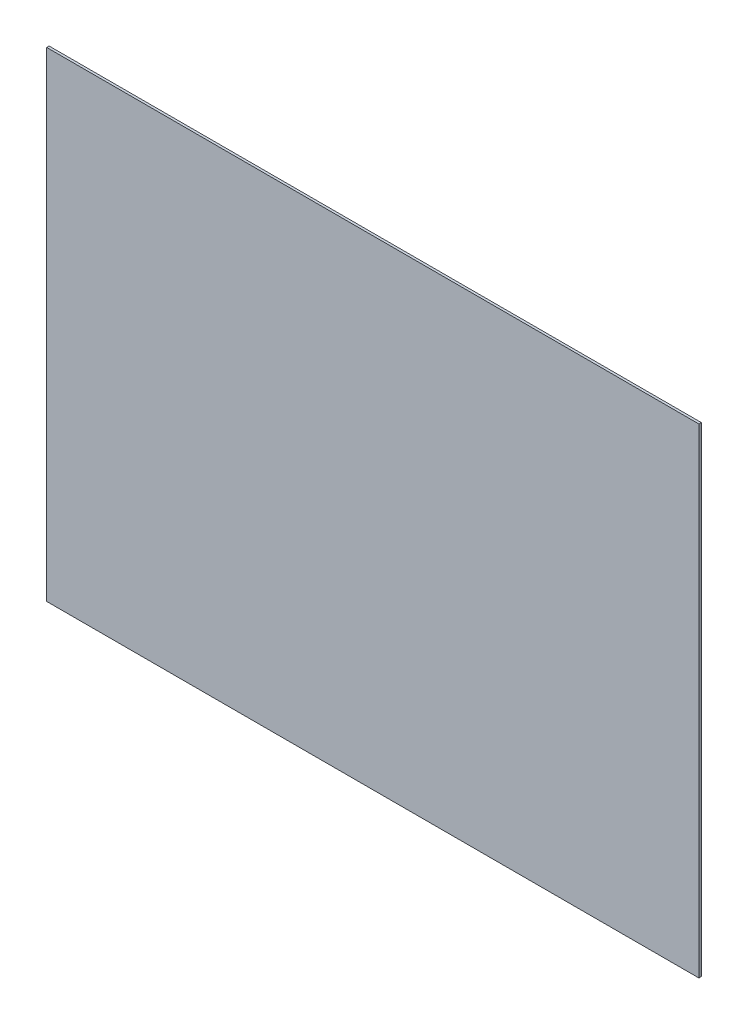
ISO-10303-21;
HEADER;
FILE_DESCRIPTION(('STEP AP214'),'2;1');
FILE_NAME('part.step','',(''),(''),'','','');
FILE_SCHEMA(('AUTOMOTIVE_DESIGN { 1 0 10303 214 1 1 1 1 }'));
ENDSEC;
DATA;
#1=APPLICATION_CONTEXT('core data for automotive mechanical design processes');
#2=APPLICATION_PROTOCOL_DEFINITION('international standard','automotive_design',2000,#1);
#3=PRODUCT_CONTEXT('',#1,'mechanical');
#4=PRODUCT('Part','Part','',(#3));
#5=PRODUCT_RELATED_PRODUCT_CATEGORY('part','',(#4));
#6=PRODUCT_DEFINITION_FORMATION('','',#4);
#7=PRODUCT_DEFINITION_CONTEXT('part definition',#1,'design');
#8=PRODUCT_DEFINITION('design','',#6,#7);
#9=PRODUCT_DEFINITION_SHAPE('','',#8);
#10=(LENGTH_UNIT() NAMED_UNIT(*) SI_UNIT(.MILLI.,.METRE.));
#11=(NAMED_UNIT(*) PLANE_ANGLE_UNIT() SI_UNIT($,.RADIAN.));
#12=(NAMED_UNIT(*) SI_UNIT($,.STERADIAN.) SOLID_ANGLE_UNIT());
#13=UNCERTAINTY_MEASURE_WITH_UNIT(LENGTH_MEASURE(1.E-05),#10,'distance_accuracy_value','');
#14=(GEOMETRIC_REPRESENTATION_CONTEXT(3) GLOBAL_UNCERTAINTY_ASSIGNED_CONTEXT((#13)) GLOBAL_UNIT_ASSIGNED_CONTEXT((#10,
#11,#12)) REPRESENTATION_CONTEXT('',''));
#15=CARTESIAN_POINT('',(0.,0.,0.));
#16=DIRECTION('',(0.,0.,1.));
#17=DIRECTION('',(1.,0.,0.));
#18=AXIS2_PLACEMENT_3D('',#15,#16,#17);
#19=CARTESIAN_POINT('',(-5500.,6058.,-50.));
#20=DIRECTION('',(-1.,0.,0.));
#21=DIRECTION('',(0.,-1.,0.));
#22=AXIS2_PLACEMENT_3D('',#19,#20,#21);
#23=PLANE('',#22);
#24=DIRECTION('',(0.,-1.,0.));
#25=VECTOR('',#24,1.);
#26=CARTESIAN_POINT('',(-5500.,6058.,0.));
#27=LINE('',#26,#25);
#28=CARTESIAN_POINT('',(-5500.,6058.,0.));
#29=VERTEX_POINT('',#28);
#30=CARTESIAN_POINT('',(-5500.,-3800.,0.));
#31=VERTEX_POINT('',#30);
#32=EDGE_CURVE('E94',#29,#31,#27,.T.);
#33=ORIENTED_EDGE('',*,*,#32,.F.);
#34=DIRECTION('',(0.,0.,1.));
#35=VECTOR('',#34,1.);
#36=CARTESIAN_POINT('',(-5500.,6058.,-50.));
#37=LINE('',#36,#35);
#38=CARTESIAN_POINT('',(-5500.,6058.,-50.));
#39=VERTEX_POINT('',#38);
#40=EDGE_CURVE('E11',#39,#29,#37,.T.);
#41=ORIENTED_EDGE('',*,*,#40,.F.);
#42=DIRECTION('',(0.,-1.,0.));
#43=VECTOR('',#42,1.);
#44=CARTESIAN_POINT('',(-5500.,6058.,-50.));
#45=LINE('',#44,#43);
#46=CARTESIAN_POINT('',(-5500.,-3800.,-50.));
#47=VERTEX_POINT('',#46);
#48=EDGE_CURVE('E88',#39,#47,#45,.T.);
#49=ORIENTED_EDGE('',*,*,#48,.T.);
#50=DIRECTION('',(0.,0.,1.));
#51=VECTOR('',#50,1.);
#52=CARTESIAN_POINT('',(-5500.,-3800.,-50.));
#53=LINE('',#52,#51);
#54=EDGE_CURVE('E33',#47,#31,#53,.T.);
#55=ORIENTED_EDGE('',*,*,#54,.T.);
#56=EDGE_LOOP('',(#33,#41,#49,#55));
#57=FACE_BOUND('',#56,.T.);
#58=ADVANCED_FACE('F30',(#57),#23,.T.);
#59=CARTESIAN_POINT('',(-5500.,6058.,-50.));
#60=DIRECTION('',(0.,1.,0.));
#61=DIRECTION('',(-1.,0.,0.));
#62=AXIS2_PLACEMENT_3D('',#59,#60,#61);
#63=PLANE('',#62);
#64=DIRECTION('',(-1.,0.,0.));
#65=VECTOR('',#64,1.);
#66=CARTESIAN_POINT('',(-5500.,6058.,0.));
#67=LINE('',#66,#65);
#68=CARTESIAN_POINT('',(7900.,6058.,0.));
#69=VERTEX_POINT('',#68);
#70=EDGE_CURVE('E90',#69,#29,#67,.T.);
#71=ORIENTED_EDGE('',*,*,#70,.F.);
#72=DIRECTION('',(0.,0.,1.));
#73=VECTOR('',#72,1.);
#74=CARTESIAN_POINT('',(7900.,6058.,-50.));
#75=LINE('',#74,#73);
#76=CARTESIAN_POINT('',(7900.,6058.,-50.));
#77=VERTEX_POINT('',#76);
#78=EDGE_CURVE('E39',#77,#69,#75,.T.);
#79=ORIENTED_EDGE('',*,*,#78,.F.);
#80=DIRECTION('',(-1.,0.,0.));
#81=VECTOR('',#80,1.);
#82=CARTESIAN_POINT('',(-5500.,6058.,-50.));
#83=LINE('',#82,#81);
#84=EDGE_CURVE('E85',#77,#39,#83,.T.);
#85=ORIENTED_EDGE('',*,*,#84,.T.);
#86=ORIENTED_EDGE('',*,*,#40,.T.);
#87=EDGE_LOOP('',(#71,#79,#85,#86));
#88=FACE_BOUND('',#87,.T.);
#89=ADVANCED_FACE('F104',(#88),#63,.T.);
#90=CARTESIAN_POINT('',(7900.,6058.,-50.));
#91=DIRECTION('',(1.,0.,0.));
#92=DIRECTION('',(0.,1.,0.));
#93=AXIS2_PLACEMENT_3D('',#90,#91,#92);
#94=PLANE('',#93);
#95=DIRECTION('',(0.,1.,0.));
#96=VECTOR('',#95,1.);
#97=CARTESIAN_POINT('',(7900.,6058.,0.));
#98=LINE('',#97,#96);
#99=CARTESIAN_POINT('',(7900.,-3800.,0.));
#100=VERTEX_POINT('',#99);
#101=EDGE_CURVE('E80',#100,#69,#98,.T.);
#102=ORIENTED_EDGE('',*,*,#101,.F.);
#103=DIRECTION('',(0.,0.,1.));
#104=VECTOR('',#103,1.);
#105=CARTESIAN_POINT('',(7900.,-3800.,-50.));
#106=LINE('',#105,#104);
#107=CARTESIAN_POINT('',(7900.,-3800.,-50.));
#108=VERTEX_POINT('',#107);
#109=EDGE_CURVE('E75',#108,#100,#106,.T.);
#110=ORIENTED_EDGE('',*,*,#109,.F.);
#111=DIRECTION('',(0.,1.,0.));
#112=VECTOR('',#111,1.);
#113=CARTESIAN_POINT('',(7900.,6058.,-50.));
#114=LINE('',#113,#112);
#115=EDGE_CURVE('E78',#108,#77,#114,.T.);
#116=ORIENTED_EDGE('',*,*,#115,.T.);
#117=ORIENTED_EDGE('',*,*,#78,.T.);
#118=EDGE_LOOP('',(#102,#110,#116,#117));
#119=FACE_BOUND('',#118,.T.);
#120=ADVANCED_FACE('F77',(#119),#94,.T.);
#121=CARTESIAN_POINT('',(-5500.,-3800.,-50.));
#122=DIRECTION('',(0.,-1.,0.));
#123=DIRECTION('',(1.,0.,0.));
#124=AXIS2_PLACEMENT_3D('',#121,#122,#123);
#125=PLANE('',#124);
#126=DIRECTION('',(1.,0.,0.));
#127=VECTOR('',#126,1.);
#128=CARTESIAN_POINT('',(-5500.,-3800.,0.));
#129=LINE('',#128,#127);
#130=EDGE_CURVE('E97',#31,#100,#129,.T.);
#131=ORIENTED_EDGE('',*,*,#130,.F.);
#132=ORIENTED_EDGE('',*,*,#54,.F.);
#133=DIRECTION('',(1.,0.,0.));
#134=VECTOR('',#133,1.);
#135=CARTESIAN_POINT('',(-5500.,-3800.,-50.));
#136=LINE('',#135,#134);
#137=EDGE_CURVE('E84',#47,#108,#136,.T.);
#138=ORIENTED_EDGE('',*,*,#137,.T.);
#139=ORIENTED_EDGE('',*,*,#109,.T.);
#140=EDGE_LOOP('',(#131,#132,#138,#139));
#141=FACE_BOUND('',#140,.T.);
#142=ADVANCED_FACE('F87',(#141),#125,.T.);
#143=CARTESIAN_POINT('',(-5500.,-3800.,-50.));
#144=DIRECTION('',(0.,0.,1.));
#145=DIRECTION('',(1.,0.,0.));
#146=AXIS2_PLACEMENT_3D('',#143,#144,#145);
#147=PLANE('',#146);
#148=ORIENTED_EDGE('',*,*,#48,.F.);
#149=ORIENTED_EDGE('',*,*,#84,.F.);
#150=ORIENTED_EDGE('',*,*,#115,.F.);
#151=ORIENTED_EDGE('',*,*,#137,.F.);
#152=EDGE_LOOP('',(#148,#149,#150,#151));
#153=FACE_BOUND('',#152,.T.);
#154=ADVANCED_FACE('F83',(#153),#147,.F.);
#155=CARTESIAN_POINT('',(-5500.,-3800.,0.));
#156=DIRECTION('',(0.,0.,1.));
#157=DIRECTION('',(1.,0.,0.));
#158=AXIS2_PLACEMENT_3D('',#155,#156,#157);
#159=PLANE('',#158);
#160=ORIENTED_EDGE('',*,*,#32,.T.);
#161=ORIENTED_EDGE('',*,*,#130,.T.);
#162=ORIENTED_EDGE('',*,*,#101,.T.);
#163=ORIENTED_EDGE('',*,*,#70,.T.);
#164=EDGE_LOOP('',(#160,#161,#162,#163));
#165=FACE_BOUND('',#164,.T.);
#166=ADVANCED_FACE('F103',(#165),#159,.T.);
#167=CLOSED_SHELL('',(#58,#89,#120,#142,#154,#166));
#168=MANIFOLD_SOLID_BREP('B2',#167);
#169=ADVANCED_BREP_SHAPE_REPRESENTATION('',(#18,#168),#14);
#170=SHAPE_DEFINITION_REPRESENTATION(#9,#169);
ENDSEC;
END-ISO-10303-21;
